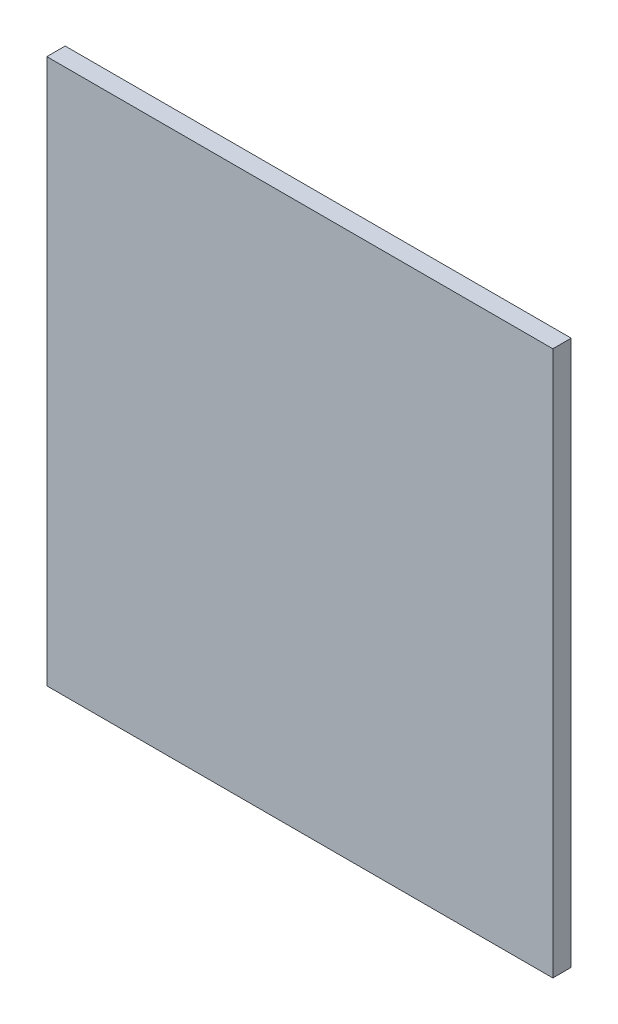
ISO-10303-21;
HEADER;
FILE_DESCRIPTION(('STEP AP214'),'2;1');
FILE_NAME('part.step','',(''),(''),'','','');
FILE_SCHEMA(('AUTOMOTIVE_DESIGN { 1 0 10303 214 1 1 1 1 }'));
ENDSEC;
DATA;
#1=APPLICATION_CONTEXT('core data for automotive mechanical design processes');
#2=APPLICATION_PROTOCOL_DEFINITION('international standard','automotive_design',2000,#1);
#3=PRODUCT_CONTEXT('',#1,'mechanical');
#4=PRODUCT('Part','Part','',(#3));
#5=PRODUCT_RELATED_PRODUCT_CATEGORY('part','',(#4));
#6=PRODUCT_DEFINITION_FORMATION('','',#4);
#7=PRODUCT_DEFINITION_CONTEXT('part definition',#1,'design');
#8=PRODUCT_DEFINITION('design','',#6,#7);
#9=PRODUCT_DEFINITION_SHAPE('','',#8);
#10=(LENGTH_UNIT() NAMED_UNIT(*) SI_UNIT(.MILLI.,.METRE.));
#11=(NAMED_UNIT(*) PLANE_ANGLE_UNIT() SI_UNIT($,.RADIAN.));
#12=(NAMED_UNIT(*) SI_UNIT($,.STERADIAN.) SOLID_ANGLE_UNIT());
#13=UNCERTAINTY_MEASURE_WITH_UNIT(LENGTH_MEASURE(1.E-05),#10,'distance_accuracy_value','');
#14=(GEOMETRIC_REPRESENTATION_CONTEXT(3) GLOBAL_UNCERTAINTY_ASSIGNED_CONTEXT((#13)) GLOBAL_UNIT_ASSIGNED_CONTEXT((#10,
#11,#12)) REPRESENTATION_CONTEXT('',''));
#15=CARTESIAN_POINT('',(0.,0.,0.));
#16=DIRECTION('',(0.,0.,1.));
#17=DIRECTION('',(1.,0.,0.));
#18=AXIS2_PLACEMENT_3D('',#15,#16,#17);
#19=CARTESIAN_POINT('',(0.,0.,2.9972));
#20=DIRECTION('',(1.,0.,0.));
#21=DIRECTION('',(0.,1.,0.));
#22=AXIS2_PLACEMENT_3D('',#19,#20,#21);
#23=PLANE('',#22);
#24=DIRECTION('',(0.,-1.,0.));
#25=VECTOR('',#24,1.);
#26=CARTESIAN_POINT('',(0.,0.,0.));
#27=LINE('',#26,#25);
#28=CARTESIAN_POINT('',(0.,0.,0.));
#29=VERTEX_POINT('',#28);
#30=CARTESIAN_POINT('',(0.,-88.9,0.));
#31=VERTEX_POINT('',#30);
#32=EDGE_CURVE('E98',#29,#31,#27,.T.);
#33=ORIENTED_EDGE('',*,*,#32,.T.);
#34=DIRECTION('',(0.,0.,-1.));
#35=VECTOR('',#34,1.);
#36=CARTESIAN_POINT('',(0.,-88.9,2.9972));
#37=LINE('',#36,#35);
#38=CARTESIAN_POINT('',(0.,-88.9,2.9972));
#39=VERTEX_POINT('',#38);
#40=EDGE_CURVE('E11',#39,#31,#37,.T.);
#41=ORIENTED_EDGE('',*,*,#40,.F.);
#42=DIRECTION('',(0.,-1.,0.));
#43=VECTOR('',#42,1.);
#44=CARTESIAN_POINT('',(0.,0.,2.9972));
#45=LINE('',#44,#43);
#46=CARTESIAN_POINT('',(0.,0.,2.9972));
#47=VERTEX_POINT('',#46);
#48=EDGE_CURVE('E86',#47,#39,#45,.T.);
#49=ORIENTED_EDGE('',*,*,#48,.F.);
#50=DIRECTION('',(0.,0.,-1.));
#51=VECTOR('',#50,1.);
#52=CARTESIAN_POINT('',(0.,0.,2.9972));
#53=LINE('',#52,#51);
#54=EDGE_CURVE('E94',#47,#29,#53,.T.);
#55=ORIENTED_EDGE('',*,*,#54,.T.);
#56=EDGE_LOOP('',(#33,#41,#49,#55));
#57=FACE_BOUND('',#56,.T.);
#58=ADVANCED_FACE('F35',(#57),#23,.F.);
#59=CARTESIAN_POINT('',(0.,-88.9,2.9972));
#60=DIRECTION('',(0.,1.,0.));
#61=DIRECTION('',(0.,0.,1.));
#62=AXIS2_PLACEMENT_3D('',#59,#60,#61);
#63=PLANE('',#62);
#64=DIRECTION('',(1.,0.,0.));
#65=VECTOR('',#64,1.);
#66=CARTESIAN_POINT('',(0.,-88.9,0.));
#67=LINE('',#66,#65);
#68=CARTESIAN_POINT('',(82.55,-88.9,0.));
#69=VERTEX_POINT('',#68);
#70=EDGE_CURVE('E90',#31,#69,#67,.T.);
#71=ORIENTED_EDGE('',*,*,#70,.T.);
#72=DIRECTION('',(0.,0.,-1.));
#73=VECTOR('',#72,1.);
#74=CARTESIAN_POINT('',(82.55,-88.9,2.9972));
#75=LINE('',#74,#73);
#76=CARTESIAN_POINT('',(82.55,-88.9,2.9972));
#77=VERTEX_POINT('',#76);
#78=EDGE_CURVE('E43',#77,#69,#75,.T.);
#79=ORIENTED_EDGE('',*,*,#78,.F.);
#80=DIRECTION('',(1.,0.,0.));
#81=VECTOR('',#80,1.);
#82=CARTESIAN_POINT('',(0.,-88.9,2.9972));
#83=LINE('',#82,#81);
#84=EDGE_CURVE('E81',#39,#77,#83,.T.);
#85=ORIENTED_EDGE('',*,*,#84,.F.);
#86=ORIENTED_EDGE('',*,*,#40,.T.);
#87=EDGE_LOOP('',(#71,#79,#85,#86));
#88=FACE_BOUND('',#87,.T.);
#89=ADVANCED_FACE('F89',(#88),#63,.F.);
#90=CARTESIAN_POINT('',(82.55,0.,2.9972));
#91=DIRECTION('',(-1.,0.,0.));
#92=DIRECTION('',(0.,-1.,0.));
#93=AXIS2_PLACEMENT_3D('',#90,#91,#92);
#94=PLANE('',#93);
#95=DIRECTION('',(0.,1.,0.));
#96=VECTOR('',#95,1.);
#97=CARTESIAN_POINT('',(82.55,0.,0.));
#98=LINE('',#97,#96);
#99=CARTESIAN_POINT('',(82.55,0.,0.));
#100=VERTEX_POINT('',#99);
#101=EDGE_CURVE('E68',#69,#100,#98,.T.);
#102=ORIENTED_EDGE('',*,*,#101,.T.);
#103=DIRECTION('',(0.,0.,-1.));
#104=VECTOR('',#103,1.);
#105=CARTESIAN_POINT('',(82.55,0.,2.9972));
#106=LINE('',#105,#104);
#107=CARTESIAN_POINT('',(82.55,0.,2.9972));
#108=VERTEX_POINT('',#107);
#109=EDGE_CURVE('E91',#108,#100,#106,.T.);
#110=ORIENTED_EDGE('',*,*,#109,.F.);
#111=DIRECTION('',(0.,1.,0.));
#112=VECTOR('',#111,1.);
#113=CARTESIAN_POINT('',(82.55,0.,2.9972));
#114=LINE('',#113,#112);
#115=EDGE_CURVE('E84',#77,#108,#114,.T.);
#116=ORIENTED_EDGE('',*,*,#115,.F.);
#117=ORIENTED_EDGE('',*,*,#78,.T.);
#118=EDGE_LOOP('',(#102,#110,#116,#117));
#119=FACE_BOUND('',#118,.T.);
#120=ADVANCED_FACE('F92',(#119),#94,.F.);
#121=CARTESIAN_POINT('',(0.,0.,2.9972));
#122=DIRECTION('',(0.,-1.,0.));
#123=DIRECTION('',(0.,0.,-1.));
#124=AXIS2_PLACEMENT_3D('',#121,#122,#123);
#125=PLANE('',#124);
#126=DIRECTION('',(-1.,0.,0.));
#127=VECTOR('',#126,1.);
#128=CARTESIAN_POINT('',(0.,0.,0.));
#129=LINE('',#128,#127);
#130=EDGE_CURVE('E74',#100,#29,#129,.T.);
#131=ORIENTED_EDGE('',*,*,#130,.T.);
#132=ORIENTED_EDGE('',*,*,#54,.F.);
#133=DIRECTION('',(-1.,0.,0.));
#134=VECTOR('',#133,1.);
#135=CARTESIAN_POINT('',(0.,0.,2.9972));
#136=LINE('',#135,#134);
#137=EDGE_CURVE('E51',#108,#47,#136,.T.);
#138=ORIENTED_EDGE('',*,*,#137,.F.);
#139=ORIENTED_EDGE('',*,*,#109,.T.);
#140=EDGE_LOOP('',(#131,#132,#138,#139));
#141=FACE_BOUND('',#140,.T.);
#142=ADVANCED_FACE('F105',(#141),#125,.F.);
#143=CARTESIAN_POINT('',(0.,0.,2.9972));
#144=DIRECTION('',(0.,0.,1.));
#145=DIRECTION('',(1.,0.,0.));
#146=AXIS2_PLACEMENT_3D('',#143,#144,#145);
#147=PLANE('',#146);
#148=ORIENTED_EDGE('',*,*,#48,.T.);
#149=ORIENTED_EDGE('',*,*,#84,.T.);
#150=ORIENTED_EDGE('',*,*,#115,.T.);
#151=ORIENTED_EDGE('',*,*,#137,.T.);
#152=EDGE_LOOP('',(#148,#149,#150,#151));
#153=FACE_BOUND('',#152,.T.);
#154=ADVANCED_FACE('F82',(#153),#147,.T.);
#155=CARTESIAN_POINT('',(0.,0.,0.));
#156=DIRECTION('',(0.,0.,1.));
#157=DIRECTION('',(1.,0.,0.));
#158=AXIS2_PLACEMENT_3D('',#155,#156,#157);
#159=PLANE('',#158);
#160=ORIENTED_EDGE('',*,*,#32,.F.);
#161=ORIENTED_EDGE('',*,*,#130,.F.);
#162=ORIENTED_EDGE('',*,*,#101,.F.);
#163=ORIENTED_EDGE('',*,*,#70,.F.);
#164=EDGE_LOOP('',(#160,#161,#162,#163));
#165=FACE_BOUND('',#164,.T.);
#166=ADVANCED_FACE('F108',(#165),#159,.F.);
#167=CLOSED_SHELL('',(#58,#89,#120,#142,#154,#166));
#168=MANIFOLD_SOLID_BREP('B2',#167);
#169=ADVANCED_BREP_SHAPE_REPRESENTATION('',(#18,#168),#14);
#170=SHAPE_DEFINITION_REPRESENTATION(#9,#169);
ENDSEC;
END-ISO-10303-21;
